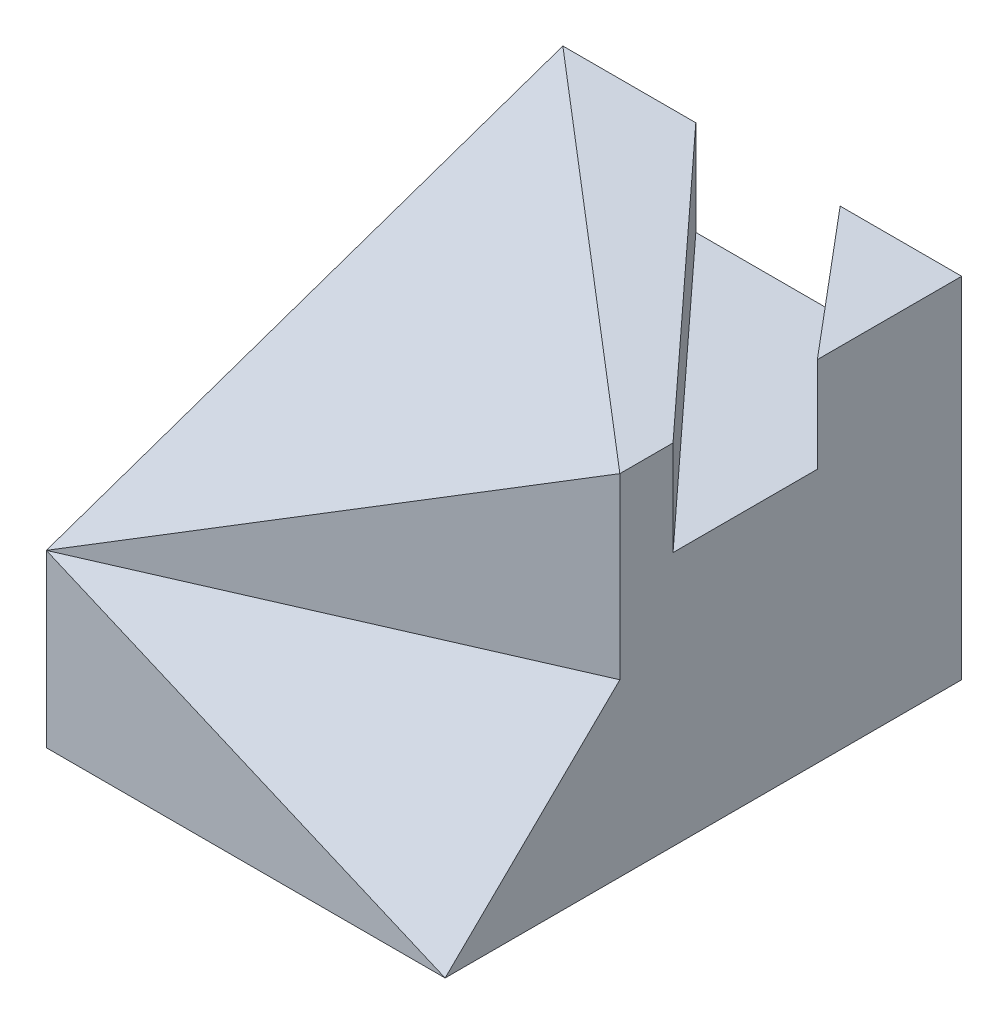
ISO-10303-21;
HEADER;
FILE_DESCRIPTION(('STEP AP214'),'2;1');
FILE_NAME('part.step','',(''),(''),'','','');
FILE_SCHEMA(('AUTOMOTIVE_DESIGN { 1 0 10303 214 1 1 1 1 }'));
ENDSEC;
DATA;
#1=APPLICATION_CONTEXT('core data for automotive mechanical design processes');
#2=APPLICATION_PROTOCOL_DEFINITION('international standard','automotive_design',2000,#1);
#3=PRODUCT_CONTEXT('',#1,'mechanical');
#4=PRODUCT('Part','Part','',(#3));
#5=PRODUCT_RELATED_PRODUCT_CATEGORY('part','',(#4));
#6=PRODUCT_DEFINITION_FORMATION('','',#4);
#7=PRODUCT_DEFINITION_CONTEXT('part definition',#1,'design');
#8=PRODUCT_DEFINITION('design','',#6,#7);
#9=PRODUCT_DEFINITION_SHAPE('','',#8);
#10=(LENGTH_UNIT() NAMED_UNIT(*) SI_UNIT(.MILLI.,.METRE.));
#11=(NAMED_UNIT(*) PLANE_ANGLE_UNIT() SI_UNIT($,.RADIAN.));
#12=(NAMED_UNIT(*) SI_UNIT($,.STERADIAN.) SOLID_ANGLE_UNIT());
#13=UNCERTAINTY_MEASURE_WITH_UNIT(LENGTH_MEASURE(1.E-05),#10,'distance_accuracy_value','');
#14=(GEOMETRIC_REPRESENTATION_CONTEXT(3) GLOBAL_UNCERTAINTY_ASSIGNED_CONTEXT((#13)) GLOBAL_UNIT_ASSIGNED_CONTEXT((#10,
#11,#12)) REPRESENTATION_CONTEXT('',''));
#15=CARTESIAN_POINT('',(0.,0.,0.));
#16=DIRECTION('',(0.,0.,1.));
#17=DIRECTION('',(1.,0.,0.));
#18=AXIS2_PLACEMENT_3D('',#15,#16,#17);
#19=CARTESIAN_POINT('',(-26.25,46.,34.));
#20=DIRECTION('',(1.,0.,0.));
#21=DIRECTION('',(0.,0.,-1.));
#22=AXIS2_PLACEMENT_3D('',#19,#20,#21);
#23=PLANE('',#22);
#24=DIRECTION('',(0.,0.326633135958244,-0.945151201921726));
#25=VECTOR('',#24,1.);
#26=CARTESIAN_POINT('',(-26.25,46.,-34.));
#27=LINE('',#26,#25);
#28=CARTESIAN_POINT('',(-26.25,22.5,34.));
#29=VERTEX_POINT('',#28);
#30=CARTESIAN_POINT('',(-26.25,46.,-34.));
#31=VERTEX_POINT('',#30);
#32=EDGE_CURVE('E100',#29,#31,#27,.T.);
#33=ORIENTED_EDGE('',*,*,#32,.T.);
#34=DIRECTION('',(0.,-1.,0.));
#35=VECTOR('',#34,1.);
#36=CARTESIAN_POINT('',(-26.25,46.,-34.));
#37=LINE('',#36,#35);
#38=CARTESIAN_POINT('',(-26.25,0.,-34.));
#39=VERTEX_POINT('',#38);
#40=EDGE_CURVE('E49',#31,#39,#37,.T.);
#41=ORIENTED_EDGE('',*,*,#40,.T.);
#42=DIRECTION('',(0.,0.,1.));
#43=VECTOR('',#42,1.);
#44=CARTESIAN_POINT('',(-26.25,0.,34.));
#45=LINE('',#44,#43);
#46=CARTESIAN_POINT('',(-26.25,0.,34.));
#47=VERTEX_POINT('',#46);
#48=EDGE_CURVE('E91',#39,#47,#45,.T.);
#49=ORIENTED_EDGE('',*,*,#48,.T.);
#50=DIRECTION('',(0.,-1.,0.));
#51=VECTOR('',#50,1.);
#52=CARTESIAN_POINT('',(-26.25,46.,34.));
#53=LINE('',#52,#51);
#54=EDGE_CURVE('E102',#29,#47,#53,.T.);
#55=ORIENTED_EDGE('',*,*,#54,.F.);
#56=EDGE_LOOP('',(#33,#41,#49,#55));
#57=FACE_BOUND('',#56,.T.);
#58=ADVANCED_FACE('F41',(#57),#23,.F.);
#59=CARTESIAN_POINT('',(0.,46.,0.));
#60=DIRECTION('',(0.,-1.,0.));
#61=DIRECTION('',(0.,0.,-1.));
#62=AXIS2_PLACEMENT_3D('',#59,#60,#61);
#63=PLANE('',#62);
#64=DIRECTION('',(0.759256602365296,0.,0.650791373455969));
#65=VECTOR('',#64,1.);
#66=CARTESIAN_POINT('',(-26.25,46.,-34.));
#67=LINE('',#66,#65);
#68=CARTESIAN_POINT('',(26.25,46.,11.));
#69=VERTEX_POINT('',#68);
#70=EDGE_CURVE('E213',#31,#69,#67,.T.);
#71=ORIENTED_EDGE('',*,*,#70,.T.);
#72=DIRECTION('',(0.,0.,-1.));
#73=VECTOR('',#72,1.);
#74=CARTESIAN_POINT('',(26.25,46.,34.));
#75=LINE('',#74,#73);
#76=CARTESIAN_POINT('',(26.25,46.,3.99999999999999));
#77=VERTEX_POINT('',#76);
#78=EDGE_CURVE('E115',#69,#77,#75,.T.);
#79=ORIENTED_EDGE('',*,*,#78,.T.);
#80=DIRECTION('',(0.67747575475179,0.,0.735545105159087));
#81=VECTOR('',#80,1.);
#82=CARTESIAN_POINT('',(12.2086923941551,46.,-11.2448482577744));
#83=LINE('',#82,#81);
#84=CARTESIAN_POINT('',(-8.75000000000001,46.,-34.));
#85=VERTEX_POINT('',#84);
#86=EDGE_CURVE('E144',#85,#77,#83,.T.);
#87=ORIENTED_EDGE('',*,*,#86,.F.);
#88=DIRECTION('',(-1.,0.,0.));
#89=VECTOR('',#88,1.);
#90=CARTESIAN_POINT('',(-26.25,46.,-34.));
#91=LINE('',#90,#89);
#92=EDGE_CURVE('E113',#85,#31,#91,.T.);
#93=ORIENTED_EDGE('',*,*,#92,.T.);
#94=EDGE_LOOP('',(#71,#79,#87,#93));
#95=FACE_BOUND('',#94,.T.);
#96=ADVANCED_FACE('F179',(#95),#63,.F.);
#97=CARTESIAN_POINT('',(8.26991857545088,22.5,18.8769880526596));
#98=DIRECTION('',(-0.401276405006734,0.,-0.915957011428414));
#99=DIRECTION('',(-0.915957011428414,0.,0.401276405006734));
#100=AXIS2_PLACEMENT_3D('',#97,#98,#99);
#101=PLANE('',#100);
#102=DIRECTION('',(-0.847491027884825,-0.379353126767493,0.371281783644781));
#103=VECTOR('',#102,1.);
#104=CARTESIAN_POINT('',(-26.25,22.5,34.));
#105=LINE('',#104,#103);
#106=EDGE_CURVE('E209',#69,#29,#105,.T.);
#107=ORIENTED_EDGE('',*,*,#106,.T.);
#108=DIRECTION('',(-0.915957011428414,0.,0.401276405006734));
#109=VECTOR('',#108,1.);
#110=CARTESIAN_POINT('',(8.26991857545088,22.5,18.8769880526596));
#111=LINE('',#110,#109);
#112=CARTESIAN_POINT('',(26.25,22.5,11.));
#113=VERTEX_POINT('',#112);
#114=EDGE_CURVE('E150',#113,#29,#111,.T.);
#115=ORIENTED_EDGE('',*,*,#114,.F.);
#116=DIRECTION('',(0.,1.,0.));
#117=VECTOR('',#116,1.);
#118=CARTESIAN_POINT('',(26.25,22.5,11.));
#119=LINE('',#118,#117);
#120=EDGE_CURVE('E145',#113,#69,#119,.T.);
#121=ORIENTED_EDGE('',*,*,#120,.T.);
#122=EDGE_LOOP('',(#107,#115,#121));
#123=FACE_BOUND('',#122,.T.);
#124=ADVANCED_FACE('F188',(#123),#101,.F.);
#125=CARTESIAN_POINT('',(-26.25,46.,34.));
#126=DIRECTION('',(0.,0.,-1.));
#127=DIRECTION('',(-1.,0.,0.));
#128=AXIS2_PLACEMENT_3D('',#125,#126,#127);
#129=PLANE('',#128);
#130=DIRECTION('',(0.919145030018058,-0.393919298579168,0.));
#131=VECTOR('',#130,1.);
#132=CARTESIAN_POINT('',(-26.25,22.5,34.));
#133=LINE('',#132,#131);
#134=CARTESIAN_POINT('',(26.25,0.,34.));
#135=VERTEX_POINT('',#134);
#136=EDGE_CURVE('E159',#29,#135,#133,.T.);
#137=ORIENTED_EDGE('',*,*,#136,.F.);
#138=ORIENTED_EDGE('',*,*,#54,.T.);
#139=DIRECTION('',(1.,0.,0.));
#140=VECTOR('',#139,1.);
#141=CARTESIAN_POINT('',(-26.25,0.,34.));
#142=LINE('',#141,#140);
#143=EDGE_CURVE('E105',#47,#135,#142,.T.);
#144=ORIENTED_EDGE('',*,*,#143,.T.);
#145=EDGE_LOOP('',(#137,#138,#144));
#146=FACE_BOUND('',#145,.T.);
#147=ADVANCED_FACE('F195',(#146),#129,.F.);
#148=CARTESIAN_POINT('',(26.25,46.,34.));
#149=DIRECTION('',(-1.,0.,0.));
#150=DIRECTION('',(0.,0.,1.));
#151=AXIS2_PLACEMENT_3D('',#148,#149,#150);
#152=PLANE('',#151);
#153=DIRECTION('',(0.,0.699294155463731,-0.714834025585147));
#154=VECTOR('',#153,1.);
#155=CARTESIAN_POINT('',(26.25,22.5,11.));
#156=LINE('',#155,#154);
#157=EDGE_CURVE('E208',#135,#113,#156,.T.);
#158=ORIENTED_EDGE('',*,*,#157,.F.);
#159=DIRECTION('',(0.,0.,-1.));
#160=VECTOR('',#159,1.);
#161=CARTESIAN_POINT('',(26.25,0.,34.));
#162=LINE('',#161,#160);
#163=CARTESIAN_POINT('',(26.25,0.,-34.));
#164=VERTEX_POINT('',#163);
#165=EDGE_CURVE('E92',#135,#164,#162,.T.);
#166=ORIENTED_EDGE('',*,*,#165,.T.);
#167=DIRECTION('',(0.,-1.,0.));
#168=VECTOR('',#167,1.);
#169=CARTESIAN_POINT('',(26.25,46.,-34.));
#170=LINE('',#169,#168);
#171=CARTESIAN_POINT('',(26.25,46.,-34.));
#172=VERTEX_POINT('',#171);
#173=EDGE_CURVE('E11',#172,#164,#170,.T.);
#174=ORIENTED_EDGE('',*,*,#173,.F.);
#175=CARTESIAN_POINT('',(26.25,46.,-15.));
#176=VERTEX_POINT('',#175);
#177=EDGE_CURVE('E65',#176,#172,#75,.T.);
#178=ORIENTED_EDGE('',*,*,#177,.F.);
#179=DIRECTION('',(0.,1.,0.));
#180=VECTOR('',#179,1.);
#181=CARTESIAN_POINT('',(26.25,33.5,-15.));
#182=LINE('',#181,#180);
#183=CARTESIAN_POINT('',(26.25,33.5,-15.));
#184=VERTEX_POINT('',#183);
#185=EDGE_CURVE('E121',#184,#176,#182,.T.);
#186=ORIENTED_EDGE('',*,*,#185,.F.);
#187=DIRECTION('',(0.,0.,-1.));
#188=VECTOR('',#187,1.);
#189=CARTESIAN_POINT('',(26.25,33.5,0.));
#190=LINE('',#189,#188);
#191=CARTESIAN_POINT('',(26.25,33.5,3.99999999999999));
#192=VERTEX_POINT('',#191);
#193=EDGE_CURVE('E135',#192,#184,#190,.T.);
#194=ORIENTED_EDGE('',*,*,#193,.F.);
#195=DIRECTION('',(0.,1.,0.));
#196=VECTOR('',#195,1.);
#197=CARTESIAN_POINT('',(26.25,33.5,3.99999999999999));
#198=LINE('',#197,#196);
#199=EDGE_CURVE('E126',#192,#77,#198,.T.);
#200=ORIENTED_EDGE('',*,*,#199,.T.);
#201=ORIENTED_EDGE('',*,*,#78,.F.);
#202=ORIENTED_EDGE('',*,*,#120,.F.);
#203=EDGE_LOOP('',(#158,#166,#174,#178,#186,#194,#200,#201,#202));
#204=FACE_BOUND('',#203,.T.);
#205=ADVANCED_FACE('F43',(#204),#152,.F.);
#206=CARTESIAN_POINT('',(-26.25,46.,-34.));
#207=DIRECTION('',(0.,0.,1.));
#208=DIRECTION('',(1.,0.,0.));
#209=AXIS2_PLACEMENT_3D('',#206,#207,#208);
#210=PLANE('',#209);
#211=DIRECTION('',(0.,1.,0.));
#212=VECTOR('',#211,1.);
#213=CARTESIAN_POINT('',(10.25,33.5,-34.));
#214=LINE('',#213,#212);
#215=CARTESIAN_POINT('',(10.25,33.5,-34.));
#216=VERTEX_POINT('',#215);
#217=CARTESIAN_POINT('',(10.25,46.,-34.));
#218=VERTEX_POINT('',#217);
#219=EDGE_CURVE('E118',#216,#218,#214,.T.);
#220=ORIENTED_EDGE('',*,*,#219,.T.);
#221=EDGE_CURVE('E110',#172,#218,#91,.T.);
#222=ORIENTED_EDGE('',*,*,#221,.F.);
#223=ORIENTED_EDGE('',*,*,#173,.T.);
#224=DIRECTION('',(-1.,0.,0.));
#225=VECTOR('',#224,1.);
#226=CARTESIAN_POINT('',(-26.25,0.,-34.));
#227=LINE('',#226,#225);
#228=EDGE_CURVE('E80',#164,#39,#227,.T.);
#229=ORIENTED_EDGE('',*,*,#228,.T.);
#230=ORIENTED_EDGE('',*,*,#40,.F.);
#231=ORIENTED_EDGE('',*,*,#92,.F.);
#232=DIRECTION('',(0.,1.,0.));
#233=VECTOR('',#232,1.);
#234=CARTESIAN_POINT('',(-8.75000000000001,33.5,-34.));
#235=LINE('',#234,#233);
#236=CARTESIAN_POINT('',(-8.75000000000001,33.5,-34.));
#237=VERTEX_POINT('',#236);
#238=EDGE_CURVE('E56',#237,#85,#235,.T.);
#239=ORIENTED_EDGE('',*,*,#238,.F.);
#240=DIRECTION('',(-1.,0.,0.));
#241=VECTOR('',#240,1.);
#242=CARTESIAN_POINT('',(0.,33.5,-34.));
#243=LINE('',#242,#241);
#244=EDGE_CURVE('E148',#216,#237,#243,.T.);
#245=ORIENTED_EDGE('',*,*,#244,.F.);
#246=EDGE_LOOP('',(#220,#222,#223,#229,#230,#231,#239,#245));
#247=FACE_BOUND('',#246,.T.);
#248=ADVANCED_FACE('F83',(#247),#210,.F.);
#249=DIRECTION('',(0.64413574578278,0.,0.764911198117051));
#250=VECTOR('',#249,1.);
#251=CARTESIAN_POINT('',(22.7491896272285,46.,-19.1572123176661));
#252=LINE('',#251,#250);
#253=EDGE_CURVE('E129',#218,#176,#252,.T.);
#254=ORIENTED_EDGE('',*,*,#253,.T.);
#255=ORIENTED_EDGE('',*,*,#177,.T.);
#256=ORIENTED_EDGE('',*,*,#221,.T.);
#257=EDGE_LOOP('',(#254,#255,#256));
#258=FACE_BOUND('',#257,.T.);
#259=ADVANCED_FACE('F176',(#258),#63,.F.);
#260=CARTESIAN_POINT('',(0.,0.,0.));
#261=DIRECTION('',(0.,-1.,0.));
#262=DIRECTION('',(0.,0.,-1.));
#263=AXIS2_PLACEMENT_3D('',#260,#261,#262);
#264=PLANE('',#263);
#265=ORIENTED_EDGE('',*,*,#165,.F.);
#266=ORIENTED_EDGE('',*,*,#143,.F.);
#267=ORIENTED_EDGE('',*,*,#48,.F.);
#268=ORIENTED_EDGE('',*,*,#228,.F.);
#269=EDGE_LOOP('',(#265,#266,#267,#268));
#270=FACE_BOUND('',#269,.T.);
#271=ADVANCED_FACE('F103',(#270),#264,.T.);
#272=CARTESIAN_POINT('',(22.7491896272285,33.5,-19.1572123176661));
#273=DIRECTION('',(-0.764911198117051,0.,0.64413574578278));
#274=DIRECTION('',(0.64413574578278,0.,0.764911198117051));
#275=AXIS2_PLACEMENT_3D('',#272,#273,#274);
#276=PLANE('',#275);
#277=ORIENTED_EDGE('',*,*,#253,.F.);
#278=ORIENTED_EDGE('',*,*,#219,.F.);
#279=DIRECTION('',(0.64413574578278,0.,0.764911198117051));
#280=VECTOR('',#279,1.);
#281=CARTESIAN_POINT('',(22.7491896272285,33.5,-19.1572123176661));
#282=LINE('',#281,#280);
#283=EDGE_CURVE('E133',#216,#184,#282,.T.);
#284=ORIENTED_EDGE('',*,*,#283,.T.);
#285=ORIENTED_EDGE('',*,*,#185,.T.);
#286=EDGE_LOOP('',(#277,#278,#284,#285));
#287=FACE_BOUND('',#286,.T.);
#288=ADVANCED_FACE('F175',(#287),#276,.T.);
#289=CARTESIAN_POINT('',(12.2086923941551,33.5,-11.2448482577744));
#290=DIRECTION('',(-0.735545105159087,0.,0.677475754751791));
#291=DIRECTION('',(0.677475754751791,0.,0.735545105159087));
#292=AXIS2_PLACEMENT_3D('',#289,#290,#291);
#293=PLANE('',#292);
#294=ORIENTED_EDGE('',*,*,#86,.T.);
#295=ORIENTED_EDGE('',*,*,#199,.F.);
#296=DIRECTION('',(0.67747575475179,0.,0.735545105159087));
#297=VECTOR('',#296,1.);
#298=CARTESIAN_POINT('',(12.2086923941551,33.5,-11.2448482577744));
#299=LINE('',#298,#297);
#300=EDGE_CURVE('E141',#237,#192,#299,.T.);
#301=ORIENTED_EDGE('',*,*,#300,.F.);
#302=ORIENTED_EDGE('',*,*,#238,.T.);
#303=EDGE_LOOP('',(#294,#295,#301,#302));
#304=FACE_BOUND('',#303,.T.);
#305=ADVANCED_FACE('F237',(#304),#293,.F.);
#306=CARTESIAN_POINT('',(0.,33.5,0.));
#307=DIRECTION('',(0.,1.,0.));
#308=DIRECTION('',(0.,0.,1.));
#309=AXIS2_PLACEMENT_3D('',#306,#307,#308);
#310=PLANE('',#309);
#311=ORIENTED_EDGE('',*,*,#244,.T.);
#312=ORIENTED_EDGE('',*,*,#300,.T.);
#313=ORIENTED_EDGE('',*,*,#193,.T.);
#314=ORIENTED_EDGE('',*,*,#283,.F.);
#315=EDGE_LOOP('',(#311,#312,#313,#314));
#316=FACE_BOUND('',#315,.T.);
#317=ADVANCED_FACE('F168',(#316),#310,.T.);
#318=CARTESIAN_POINT('',(8.91127851391961,20.7929831991458,20.3409618252513));
#319=DIRECTION('',(0.292919697291404,0.683479293679943,0.668621048165161));
#320=DIRECTION('',(0.,-0.699294155463731,0.714834025585147));
#321=AXIS2_PLACEMENT_3D('',#318,#319,#320);
#322=PLANE('',#321);
#323=ORIENTED_EDGE('',*,*,#157,.T.);
#324=ORIENTED_EDGE('',*,*,#114,.T.);
#325=ORIENTED_EDGE('',*,*,#136,.T.);
#326=EDGE_LOOP('',(#323,#324,#325));
#327=FACE_BOUND('',#326,.T.);
#328=ADVANCED_FACE('F229',(#327),#322,.T.);
#329=CARTESIAN_POINT('',(-10.3123267362479,34.8132448684681,12.0310478589559));
#330=DIRECTION('',(-0.269604261127868,0.91015339217635,0.31453830464918));
#331=DIRECTION('',(0.,-0.326633135958244,0.945151201921726));
#332=AXIS2_PLACEMENT_3D('',#329,#330,#331);
#333=PLANE('',#332);
#334=ORIENTED_EDGE('',*,*,#32,.F.);
#335=ORIENTED_EDGE('',*,*,#106,.F.);
#336=ORIENTED_EDGE('',*,*,#70,.F.);
#337=EDGE_LOOP('',(#334,#335,#336));
#338=FACE_BOUND('',#337,.T.);
#339=ADVANCED_FACE('F221',(#338),#333,.T.);
#340=CLOSED_SHELL('',(#58,#96,#124,#147,#205,#248,#259,#271,#288,#305,#317,#328,#339));
#341=MANIFOLD_SOLID_BREP('B2',#340);
#342=ADVANCED_BREP_SHAPE_REPRESENTATION('',(#18,#341),#14);
#343=SHAPE_DEFINITION_REPRESENTATION(#9,#342);
ENDSEC;
END-ISO-10303-21;
